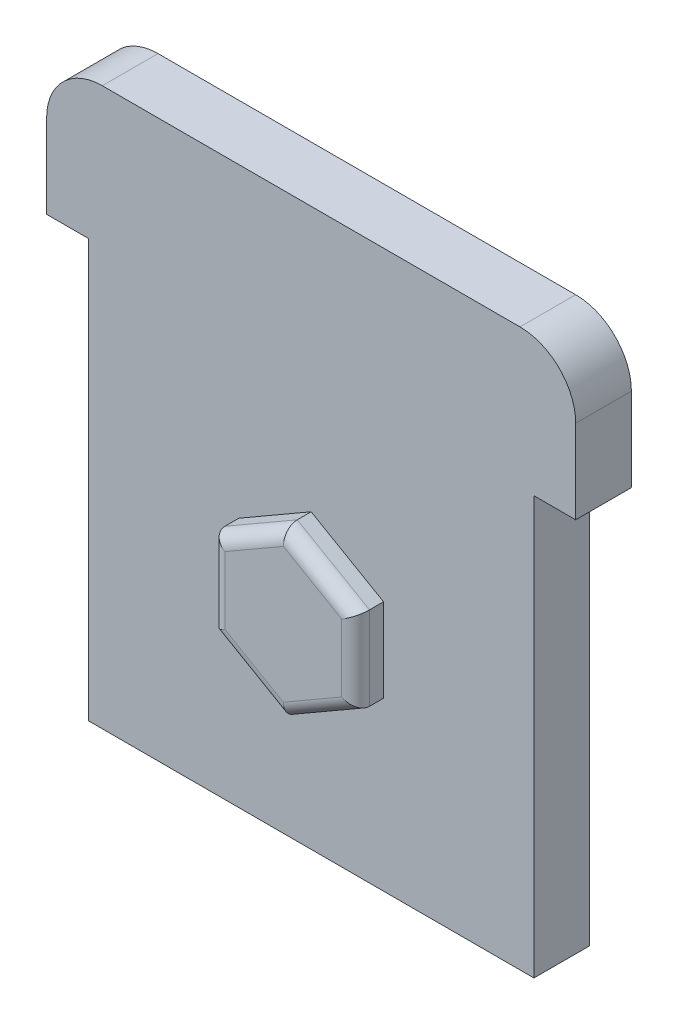
ISO-10303-21;
HEADER;
FILE_DESCRIPTION(('STEP AP214'),'2;1');
FILE_NAME('part.step','',(''),(''),'','','');
FILE_SCHEMA(('AUTOMOTIVE_DESIGN { 1 0 10303 214 1 1 1 1 }'));
ENDSEC;
DATA;
#1=APPLICATION_CONTEXT('core data for automotive mechanical design processes');
#2=APPLICATION_PROTOCOL_DEFINITION('international standard','automotive_design',2000,#1);
#3=PRODUCT_CONTEXT('',#1,'mechanical');
#4=PRODUCT('Part','Part','',(#3));
#5=PRODUCT_RELATED_PRODUCT_CATEGORY('part','',(#4));
#6=PRODUCT_DEFINITION_FORMATION('','',#4);
#7=PRODUCT_DEFINITION_CONTEXT('part definition',#1,'design');
#8=PRODUCT_DEFINITION('design','',#6,#7);
#9=PRODUCT_DEFINITION_SHAPE('','',#8);
#10=(LENGTH_UNIT() NAMED_UNIT(*) SI_UNIT(.MILLI.,.METRE.));
#11=(NAMED_UNIT(*) PLANE_ANGLE_UNIT() SI_UNIT($,.RADIAN.));
#12=(NAMED_UNIT(*) SI_UNIT($,.STERADIAN.) SOLID_ANGLE_UNIT());
#13=UNCERTAINTY_MEASURE_WITH_UNIT(LENGTH_MEASURE(1.E-05),#10,'distance_accuracy_value','');
#14=(GEOMETRIC_REPRESENTATION_CONTEXT(3) GLOBAL_UNCERTAINTY_ASSIGNED_CONTEXT((#13)) GLOBAL_UNIT_ASSIGNED_CONTEXT((#10,
#11,#12)) REPRESENTATION_CONTEXT('',''));
#15=CARTESIAN_POINT('',(0.,0.,0.));
#16=DIRECTION('',(0.,0.,1.));
#17=DIRECTION('',(1.,0.,0.));
#18=AXIS2_PLACEMENT_3D('',#15,#16,#17);
#19=CARTESIAN_POINT('',(0.,0.,2.));
#20=DIRECTION('',(0.,1.,0.));
#21=DIRECTION('',(-1.,0.,0.));
#22=AXIS2_PLACEMENT_3D('',#19,#20,#21);
#23=PLANE('',#22);
#24=DIRECTION('',(1.,0.,0.));
#25=VECTOR('',#24,1.);
#26=CARTESIAN_POINT('',(0.,0.,0.));
#27=LINE('',#26,#25);
#28=CARTESIAN_POINT('',(-1.5,0.,0.));
#29=VERTEX_POINT('',#28);
#30=CARTESIAN_POINT('',(0.,0.,0.));
#31=VERTEX_POINT('',#30);
#32=EDGE_CURVE('E204',#29,#31,#27,.T.);
#33=ORIENTED_EDGE('',*,*,#32,.T.);
#34=DIRECTION('',(0.,0.,-1.));
#35=VECTOR('',#34,1.);
#36=CARTESIAN_POINT('',(0.,0.,2.));
#37=LINE('',#36,#35);
#38=CARTESIAN_POINT('',(0.,0.,2.));
#39=VERTEX_POINT('',#38);
#40=EDGE_CURVE('E257',#39,#31,#37,.T.);
#41=ORIENTED_EDGE('',*,*,#40,.F.);
#42=DIRECTION('',(1.,0.,0.));
#43=VECTOR('',#42,1.);
#44=CARTESIAN_POINT('',(0.,0.,2.));
#45=LINE('',#44,#43);
#46=CARTESIAN_POINT('',(-1.5,0.,2.));
#47=VERTEX_POINT('',#46);
#48=EDGE_CURVE('E205',#47,#39,#45,.T.);
#49=ORIENTED_EDGE('',*,*,#48,.F.);
#50=DIRECTION('',(0.,0.,-1.));
#51=VECTOR('',#50,1.);
#52=CARTESIAN_POINT('',(-1.5,0.,2.));
#53=LINE('',#52,#51);
#54=EDGE_CURVE('E226',#47,#29,#53,.T.);
#55=ORIENTED_EDGE('',*,*,#54,.T.);
#56=EDGE_LOOP('',(#33,#41,#49,#55));
#57=FACE_BOUND('',#56,.T.);
#58=ADVANCED_FACE('F33',(#57),#23,.F.);
#59=CARTESIAN_POINT('',(0.,0.,2.));
#60=DIRECTION('',(1.,0.,0.));
#61=DIRECTION('',(0.,1.,0.));
#62=AXIS2_PLACEMENT_3D('',#59,#60,#61);
#63=PLANE('',#62);
#64=DIRECTION('',(0.,-1.,0.));
#65=VECTOR('',#64,1.);
#66=CARTESIAN_POINT('',(0.,0.,0.));
#67=LINE('',#66,#65);
#68=CARTESIAN_POINT('',(0.,-15.,0.));
#69=VERTEX_POINT('',#68);
#70=EDGE_CURVE('E229',#31,#69,#67,.T.);
#71=ORIENTED_EDGE('',*,*,#70,.T.);
#72=DIRECTION('',(0.,0.,-1.));
#73=VECTOR('',#72,1.);
#74=CARTESIAN_POINT('',(0.,-15.,2.));
#75=LINE('',#74,#73);
#76=CARTESIAN_POINT('',(0.,-15.,2.));
#77=VERTEX_POINT('',#76);
#78=EDGE_CURVE('E254',#77,#69,#75,.T.);
#79=ORIENTED_EDGE('',*,*,#78,.F.);
#80=DIRECTION('',(0.,-1.,0.));
#81=VECTOR('',#80,1.);
#82=CARTESIAN_POINT('',(0.,0.,2.));
#83=LINE('',#82,#81);
#84=EDGE_CURVE('E208',#39,#77,#83,.T.);
#85=ORIENTED_EDGE('',*,*,#84,.F.);
#86=ORIENTED_EDGE('',*,*,#40,.T.);
#87=EDGE_LOOP('',(#71,#79,#85,#86));
#88=FACE_BOUND('',#87,.T.);
#89=ADVANCED_FACE('F359',(#88),#63,.F.);
#90=CARTESIAN_POINT('',(0.,-15.,2.));
#91=DIRECTION('',(0.,1.,0.));
#92=DIRECTION('',(0.,0.,1.));
#93=AXIS2_PLACEMENT_3D('',#90,#91,#92);
#94=PLANE('',#93);
#95=DIRECTION('',(1.,0.,0.));
#96=VECTOR('',#95,1.);
#97=CARTESIAN_POINT('',(0.,-15.,0.));
#98=LINE('',#97,#96);
#99=CARTESIAN_POINT('',(16.,-15.,0.));
#100=VERTEX_POINT('',#99);
#101=EDGE_CURVE('E232',#69,#100,#98,.T.);
#102=ORIENTED_EDGE('',*,*,#101,.T.);
#103=DIRECTION('',(0.,0.,-1.));
#104=VECTOR('',#103,1.);
#105=CARTESIAN_POINT('',(16.,-15.,2.));
#106=LINE('',#105,#104);
#107=CARTESIAN_POINT('',(16.,-15.,2.));
#108=VERTEX_POINT('',#107);
#109=EDGE_CURVE('E252',#108,#100,#106,.T.);
#110=ORIENTED_EDGE('',*,*,#109,.F.);
#111=DIRECTION('',(1.,0.,0.));
#112=VECTOR('',#111,1.);
#113=CARTESIAN_POINT('',(0.,-15.,2.));
#114=LINE('',#113,#112);
#115=EDGE_CURVE('E212',#77,#108,#114,.T.);
#116=ORIENTED_EDGE('',*,*,#115,.F.);
#117=ORIENTED_EDGE('',*,*,#78,.T.);
#118=EDGE_LOOP('',(#102,#110,#116,#117));
#119=FACE_BOUND('',#118,.T.);
#120=ADVANCED_FACE('F366',(#119),#94,.F.);
#121=CARTESIAN_POINT('',(16.,0.,2.));
#122=DIRECTION('',(1.,0.,0.));
#123=DIRECTION('',(0.,1.,0.));
#124=AXIS2_PLACEMENT_3D('',#121,#122,#123);
#125=PLANE('',#124);
#126=DIRECTION('',(0.,-1.,0.));
#127=VECTOR('',#126,1.);
#128=CARTESIAN_POINT('',(16.,0.,0.));
#129=LINE('',#128,#127);
#130=CARTESIAN_POINT('',(16.,0.,0.));
#131=VERTEX_POINT('',#130);
#132=EDGE_CURVE('E235',#131,#100,#129,.T.);
#133=ORIENTED_EDGE('',*,*,#132,.F.);
#134=DIRECTION('',(0.,0.,-1.));
#135=VECTOR('',#134,1.);
#136=CARTESIAN_POINT('',(16.,0.,2.));
#137=LINE('',#136,#135);
#138=CARTESIAN_POINT('',(16.,0.,2.));
#139=VERTEX_POINT('',#138);
#140=EDGE_CURVE('E250',#139,#131,#137,.T.);
#141=ORIENTED_EDGE('',*,*,#140,.F.);
#142=DIRECTION('',(0.,-1.,0.));
#143=VECTOR('',#142,1.);
#144=CARTESIAN_POINT('',(16.,0.,2.));
#145=LINE('',#144,#143);
#146=EDGE_CURVE('E214',#139,#108,#145,.T.);
#147=ORIENTED_EDGE('',*,*,#146,.T.);
#148=ORIENTED_EDGE('',*,*,#109,.T.);
#149=EDGE_LOOP('',(#133,#141,#147,#148));
#150=FACE_BOUND('',#149,.T.);
#151=ADVANCED_FACE('F373',(#150),#125,.T.);
#152=CARTESIAN_POINT('',(17.5,0.,0.));
#153=VERTEX_POINT('',#152);
#154=EDGE_CURVE('E230',#131,#153,#27,.T.);
#155=ORIENTED_EDGE('',*,*,#154,.T.);
#156=DIRECTION('',(0.,0.,-1.));
#157=VECTOR('',#156,1.);
#158=CARTESIAN_POINT('',(17.5,0.,2.));
#159=LINE('',#158,#157);
#160=CARTESIAN_POINT('',(17.5,0.,2.));
#161=VERTEX_POINT('',#160);
#162=EDGE_CURVE('E247',#161,#153,#159,.T.);
#163=ORIENTED_EDGE('',*,*,#162,.F.);
#164=EDGE_CURVE('E210',#139,#161,#45,.T.);
#165=ORIENTED_EDGE('',*,*,#164,.F.);
#166=ORIENTED_EDGE('',*,*,#140,.T.);
#167=EDGE_LOOP('',(#155,#163,#165,#166));
#168=FACE_BOUND('',#167,.T.);
#169=ADVANCED_FACE('F362',(#168),#23,.F.);
#170=CARTESIAN_POINT('',(17.5,0.,2.));
#171=DIRECTION('',(-1.,0.,0.));
#172=DIRECTION('',(0.,0.,1.));
#173=AXIS2_PLACEMENT_3D('',#170,#171,#172);
#174=PLANE('',#173);
#175=DIRECTION('',(0.,1.,0.));
#176=VECTOR('',#175,1.);
#177=CARTESIAN_POINT('',(17.5,0.,0.));
#178=LINE('',#177,#176);
#179=CARTESIAN_POINT('',(17.5,3.,0.));
#180=VERTEX_POINT('',#179);
#181=EDGE_CURVE('E238',#153,#180,#178,.T.);
#182=ORIENTED_EDGE('',*,*,#181,.T.);
#183=DIRECTION('',(0.,0.,-1.));
#184=VECTOR('',#183,1.);
#185=CARTESIAN_POINT('',(17.5,3.,2.));
#186=LINE('',#185,#184);
#187=CARTESIAN_POINT('',(17.5,3.,2.));
#188=VERTEX_POINT('',#187);
#189=EDGE_CURVE('E276',#180,#188,#186,.F.);
#190=ORIENTED_EDGE('',*,*,#189,.T.);
#191=DIRECTION('',(0.,1.,0.));
#192=VECTOR('',#191,1.);
#193=CARTESIAN_POINT('',(17.5,0.,2.));
#194=LINE('',#193,#192);
#195=EDGE_CURVE('E217',#161,#188,#194,.T.);
#196=ORIENTED_EDGE('',*,*,#195,.F.);
#197=ORIENTED_EDGE('',*,*,#162,.T.);
#198=EDGE_LOOP('',(#182,#190,#196,#197));
#199=FACE_BOUND('',#198,.T.);
#200=ADVANCED_FACE('F372',(#199),#174,.F.);
#201=CARTESIAN_POINT('',(0.,5.,2.));
#202=DIRECTION('',(0.,1.,0.));
#203=DIRECTION('',(0.,0.,1.));
#204=AXIS2_PLACEMENT_3D('',#201,#202,#203);
#205=PLANE('',#204);
#206=DIRECTION('',(1.,0.,0.));
#207=VECTOR('',#206,1.);
#208=CARTESIAN_POINT('',(0.,5.,0.));
#209=LINE('',#208,#207);
#210=CARTESIAN_POINT('',(0.5,5.,0.));
#211=VERTEX_POINT('',#210);
#212=CARTESIAN_POINT('',(15.5,5.,0.));
#213=VERTEX_POINT('',#212);
#214=EDGE_CURVE('E241',#211,#213,#209,.T.);
#215=ORIENTED_EDGE('',*,*,#214,.F.);
#216=DIRECTION('',(0.,0.,-1.));
#217=VECTOR('',#216,1.);
#218=CARTESIAN_POINT('',(0.5,5.,2.));
#219=LINE('',#218,#217);
#220=CARTESIAN_POINT('',(0.5,5.,2.));
#221=VERTEX_POINT('',#220);
#222=EDGE_CURVE('E270',#211,#221,#219,.F.);
#223=ORIENTED_EDGE('',*,*,#222,.T.);
#224=DIRECTION('',(1.,0.,0.));
#225=VECTOR('',#224,1.);
#226=CARTESIAN_POINT('',(0.,5.,2.));
#227=LINE('',#226,#225);
#228=CARTESIAN_POINT('',(15.5,5.,2.));
#229=VERTEX_POINT('',#228);
#230=EDGE_CURVE('E220',#221,#229,#227,.T.);
#231=ORIENTED_EDGE('',*,*,#230,.T.);
#232=DIRECTION('',(0.,0.,-1.));
#233=VECTOR('',#232,1.);
#234=CARTESIAN_POINT('',(15.5,5.,0.));
#235=LINE('',#234,#233);
#236=EDGE_CURVE('E267',#229,#213,#235,.T.);
#237=ORIENTED_EDGE('',*,*,#236,.T.);
#238=EDGE_LOOP('',(#215,#223,#231,#237));
#239=FACE_BOUND('',#238,.T.);
#240=ADVANCED_FACE('F379',(#239),#205,.T.);
#241=CARTESIAN_POINT('',(-1.5,0.,2.));
#242=DIRECTION('',(-1.,0.,0.));
#243=DIRECTION('',(0.,0.,1.));
#244=AXIS2_PLACEMENT_3D('',#241,#242,#243);
#245=PLANE('',#244);
#246=DIRECTION('',(0.,1.,0.));
#247=VECTOR('',#246,1.);
#248=CARTESIAN_POINT('',(-1.5,0.,2.));
#249=LINE('',#248,#247);
#250=CARTESIAN_POINT('',(-1.5,3.,2.));
#251=VERTEX_POINT('',#250);
#252=EDGE_CURVE('E223',#47,#251,#249,.T.);
#253=ORIENTED_EDGE('',*,*,#252,.T.);
#254=DIRECTION('',(0.,0.,-1.));
#255=VECTOR('',#254,1.);
#256=CARTESIAN_POINT('',(-1.5,3.,2.));
#257=LINE('',#256,#255);
#258=CARTESIAN_POINT('',(-1.5,3.,0.));
#259=VERTEX_POINT('',#258);
#260=EDGE_CURVE('E260',#251,#259,#257,.T.);
#261=ORIENTED_EDGE('',*,*,#260,.T.);
#262=DIRECTION('',(0.,1.,0.));
#263=VECTOR('',#262,1.);
#264=CARTESIAN_POINT('',(-1.5,0.,0.));
#265=LINE('',#264,#263);
#266=EDGE_CURVE('E209',#29,#259,#265,.T.);
#267=ORIENTED_EDGE('',*,*,#266,.F.);
#268=ORIENTED_EDGE('',*,*,#54,.F.);
#269=EDGE_LOOP('',(#253,#261,#267,#268));
#270=FACE_BOUND('',#269,.T.);
#271=ADVANCED_FACE('F406',(#270),#245,.T.);
#272=CARTESIAN_POINT('',(0.,0.,2.));
#273=DIRECTION('',(0.,0.,1.));
#274=DIRECTION('',(1.,0.,0.));
#275=AXIS2_PLACEMENT_3D('',#272,#273,#274);
#276=PLANE('',#275);
#277=DIRECTION('',(-0.866025403784439,0.5,0.));
#278=VECTOR('',#277,1.);
#279=CARTESIAN_POINT('',(10.5980762113533,-6.,2.));
#280=LINE('',#279,#278);
#281=CARTESIAN_POINT('',(10.5980762113533,-6.,2.));
#282=VERTEX_POINT('',#281);
#283=CARTESIAN_POINT('',(8.,-4.5,2.));
#284=VERTEX_POINT('',#283);
#285=EDGE_CURVE('E185',#282,#284,#280,.T.);
#286=ORIENTED_EDGE('',*,*,#285,.F.);
#287=DIRECTION('',(0.,1.,0.));
#288=VECTOR('',#287,1.);
#289=CARTESIAN_POINT('',(10.5980762113533,-9.,2.));
#290=LINE('',#289,#288);
#291=CARTESIAN_POINT('',(10.5980762113533,-9.,2.));
#292=VERTEX_POINT('',#291);
#293=EDGE_CURVE('E193',#292,#282,#290,.T.);
#294=ORIENTED_EDGE('',*,*,#293,.F.);
#295=DIRECTION('',(0.866025403784438,0.5,0.));
#296=VECTOR('',#295,1.);
#297=CARTESIAN_POINT('',(8.,-10.5,2.));
#298=LINE('',#297,#296);
#299=CARTESIAN_POINT('',(8.,-10.5,2.));
#300=VERTEX_POINT('',#299);
#301=EDGE_CURVE('E190',#300,#292,#298,.T.);
#302=ORIENTED_EDGE('',*,*,#301,.F.);
#303=DIRECTION('',(0.866025403784439,-0.5,0.));
#304=VECTOR('',#303,1.);
#305=CARTESIAN_POINT('',(5.40192378864669,-9.,2.));
#306=LINE('',#305,#304);
#307=CARTESIAN_POINT('',(5.40192378864669,-9.,2.));
#308=VERTEX_POINT('',#307);
#309=EDGE_CURVE('E182',#308,#300,#306,.T.);
#310=ORIENTED_EDGE('',*,*,#309,.F.);
#311=DIRECTION('',(0.,-1.,0.));
#312=VECTOR('',#311,1.);
#313=CARTESIAN_POINT('',(5.40192378864669,-6.,2.));
#314=LINE('',#313,#312);
#315=CARTESIAN_POINT('',(5.40192378864669,-6.,2.));
#316=VERTEX_POINT('',#315);
#317=EDGE_CURVE('E166',#316,#308,#314,.T.);
#318=ORIENTED_EDGE('',*,*,#317,.F.);
#319=DIRECTION('',(-0.866025403784439,-0.5,0.));
#320=VECTOR('',#319,1.);
#321=CARTESIAN_POINT('',(8.,-4.5,2.));
#322=LINE('',#321,#320);
#323=EDGE_CURVE('E178',#284,#316,#322,.T.);
#324=ORIENTED_EDGE('',*,*,#323,.F.);
#325=EDGE_LOOP('',(#286,#294,#302,#310,#318,#324));
#326=FACE_BOUND('',#325,.T.);
#327=ORIENTED_EDGE('',*,*,#230,.F.);
#328=CARTESIAN_POINT('',(0.5,3.,2.));
#329=DIRECTION('',(0.,0.,1.));
#330=DIRECTION('',(1.,0.,0.));
#331=AXIS2_PLACEMENT_3D('',#328,#329,#330);
#332=CIRCLE('',#331,2.);
#333=EDGE_CURVE('E274',#221,#251,#332,.T.);
#334=ORIENTED_EDGE('',*,*,#333,.T.);
#335=ORIENTED_EDGE('',*,*,#252,.F.);
#336=ORIENTED_EDGE('',*,*,#48,.T.);
#337=ORIENTED_EDGE('',*,*,#84,.T.);
#338=ORIENTED_EDGE('',*,*,#115,.T.);
#339=ORIENTED_EDGE('',*,*,#146,.F.);
#340=ORIENTED_EDGE('',*,*,#164,.T.);
#341=ORIENTED_EDGE('',*,*,#195,.T.);
#342=CARTESIAN_POINT('',(15.5,3.,2.));
#343=DIRECTION('',(0.,0.,1.));
#344=DIRECTION('',(1.,0.,0.));
#345=AXIS2_PLACEMENT_3D('',#342,#343,#344);
#346=CIRCLE('',#345,2.);
#347=EDGE_CURVE('E272',#188,#229,#346,.T.);
#348=ORIENTED_EDGE('',*,*,#347,.T.);
#349=EDGE_LOOP('',(#327,#334,#335,#336,#337,#338,#339,#340,#341,#348));
#350=FACE_BOUND('',#349,.T.);
#351=ADVANCED_FACE('F176',(#326,#350),#276,.T.);
#352=CARTESIAN_POINT('',(0.,0.,0.));
#353=DIRECTION('',(0.,0.,1.));
#354=DIRECTION('',(1.,0.,0.));
#355=AXIS2_PLACEMENT_3D('',#352,#353,#354);
#356=PLANE('',#355);
#357=ORIENTED_EDGE('',*,*,#266,.T.);
#358=CARTESIAN_POINT('',(0.5,3.,0.));
#359=DIRECTION('',(0.,0.,1.));
#360=DIRECTION('',(1.,0.,0.));
#361=AXIS2_PLACEMENT_3D('',#358,#359,#360);
#362=CIRCLE('',#361,2.);
#363=EDGE_CURVE('E265',#259,#211,#362,.F.);
#364=ORIENTED_EDGE('',*,*,#363,.T.);
#365=ORIENTED_EDGE('',*,*,#214,.T.);
#366=CARTESIAN_POINT('',(15.5,3.,0.));
#367=DIRECTION('',(0.,0.,1.));
#368=DIRECTION('',(1.,0.,0.));
#369=AXIS2_PLACEMENT_3D('',#366,#367,#368);
#370=CIRCLE('',#369,2.);
#371=EDGE_CURVE('E263',#213,#180,#370,.F.);
#372=ORIENTED_EDGE('',*,*,#371,.T.);
#373=ORIENTED_EDGE('',*,*,#181,.F.);
#374=ORIENTED_EDGE('',*,*,#154,.F.);
#375=ORIENTED_EDGE('',*,*,#132,.T.);
#376=ORIENTED_EDGE('',*,*,#101,.F.);
#377=ORIENTED_EDGE('',*,*,#70,.F.);
#378=ORIENTED_EDGE('',*,*,#32,.F.);
#379=EDGE_LOOP('',(#357,#364,#365,#372,#373,#374,#375,#376,#377,#378));
#380=FACE_BOUND('',#379,.T.);
#381=ADVANCED_FACE('F390',(#380),#356,.F.);
#382=CARTESIAN_POINT('',(0.5,3.,2.));
#383=DIRECTION('',(0.,0.,-1.));
#384=DIRECTION('',(-1.,0.,0.));
#385=AXIS2_PLACEMENT_3D('',#382,#383,#384);
#386=CYLINDRICAL_SURFACE('',#385,2.);
#387=ORIENTED_EDGE('',*,*,#333,.F.);
#388=ORIENTED_EDGE('',*,*,#222,.F.);
#389=ORIENTED_EDGE('',*,*,#363,.F.);
#390=ORIENTED_EDGE('',*,*,#260,.F.);
#391=EDGE_LOOP('',(#387,#388,#389,#390));
#392=FACE_BOUND('',#391,.T.);
#393=ADVANCED_FACE('F403',(#392),#386,.T.);
#394=CARTESIAN_POINT('',(15.5,3.,2.));
#395=DIRECTION('',(0.,0.,1.));
#396=DIRECTION('',(1.,0.,0.));
#397=AXIS2_PLACEMENT_3D('',#394,#395,#396);
#398=CYLINDRICAL_SURFACE('',#397,2.);
#399=ORIENTED_EDGE('',*,*,#347,.F.);
#400=ORIENTED_EDGE('',*,*,#189,.F.);
#401=ORIENTED_EDGE('',*,*,#371,.F.);
#402=ORIENTED_EDGE('',*,*,#236,.F.);
#403=EDGE_LOOP('',(#399,#400,#401,#402));
#404=FACE_BOUND('',#403,.T.);
#405=ADVANCED_FACE('F395',(#404),#398,.T.);
#406=CARTESIAN_POINT('',(10.5980762113533,-6.,3.));
#407=DIRECTION('',(-0.5,-0.866025403784439,0.));
#408=DIRECTION('',(0.866025403784439,-0.5,0.));
#409=AXIS2_PLACEMENT_3D('',#406,#407,#408);
#410=PLANE('',#409);
#411=DIRECTION('',(0.,0.,-1.));
#412=VECTOR('',#411,1.);
#413=CARTESIAN_POINT('',(8.,-4.5,3.));
#414=LINE('',#413,#412);
#415=CARTESIAN_POINT('',(8.,-4.5,2.5));
#416=VERTEX_POINT('',#415);
#417=EDGE_CURVE('E169',#416,#284,#414,.T.);
#418=ORIENTED_EDGE('',*,*,#417,.F.);
#419=DIRECTION('',(-0.866025403784439,0.5,0.));
#420=VECTOR('',#419,1.);
#421=CARTESIAN_POINT('',(10.5980762113533,-6.,2.5));
#422=LINE('',#421,#420);
#423=CARTESIAN_POINT('',(10.5980762113533,-6.,2.5));
#424=VERTEX_POINT('',#423);
#425=EDGE_CURVE('E11',#416,#424,#422,.F.);
#426=ORIENTED_EDGE('',*,*,#425,.T.);
#427=DIRECTION('',(0.,0.,-1.));
#428=VECTOR('',#427,1.);
#429=CARTESIAN_POINT('',(10.5980762113533,-6.,3.));
#430=LINE('',#429,#428);
#431=EDGE_CURVE('E196',#424,#282,#430,.T.);
#432=ORIENTED_EDGE('',*,*,#431,.T.);
#433=ORIENTED_EDGE('',*,*,#285,.T.);
#434=EDGE_LOOP('',(#418,#426,#432,#433));
#435=FACE_BOUND('',#434,.T.);
#436=ADVANCED_FACE('F331',(#435),#410,.F.);
#437=CARTESIAN_POINT('',(8.,-4.5,3.));
#438=DIRECTION('',(0.5,-0.866025403784439,0.));
#439=DIRECTION('',(0.866025403784439,0.5,0.));
#440=AXIS2_PLACEMENT_3D('',#437,#438,#439);
#441=PLANE('',#440);
#442=DIRECTION('',(0.,0.,-1.));
#443=VECTOR('',#442,1.);
#444=CARTESIAN_POINT('',(5.40192378864669,-6.,3.));
#445=LINE('',#444,#443);
#446=CARTESIAN_POINT('',(5.40192378864669,-6.,2.5));
#447=VERTEX_POINT('',#446);
#448=EDGE_CURVE('E163',#447,#316,#445,.T.);
#449=ORIENTED_EDGE('',*,*,#448,.F.);
#450=DIRECTION('',(-0.866025403784439,-0.5,0.));
#451=VECTOR('',#450,1.);
#452=CARTESIAN_POINT('',(8.,-4.5,2.5));
#453=LINE('',#452,#451);
#454=EDGE_CURVE('E42',#447,#416,#453,.F.);
#455=ORIENTED_EDGE('',*,*,#454,.T.);
#456=ORIENTED_EDGE('',*,*,#417,.T.);
#457=ORIENTED_EDGE('',*,*,#323,.T.);
#458=EDGE_LOOP('',(#449,#455,#456,#457));
#459=FACE_BOUND('',#458,.T.);
#460=ADVANCED_FACE('F184',(#459),#441,.F.);
#461=CARTESIAN_POINT('',(5.40192378864669,-6.,3.));
#462=DIRECTION('',(1.,0.,0.));
#463=DIRECTION('',(0.,1.,0.));
#464=AXIS2_PLACEMENT_3D('',#461,#462,#463);
#465=PLANE('',#464);
#466=DIRECTION('',(0.,0.,-1.));
#467=VECTOR('',#466,1.);
#468=CARTESIAN_POINT('',(5.40192378864669,-9.,3.));
#469=LINE('',#468,#467);
#470=CARTESIAN_POINT('',(5.40192378864669,-9.,2.5));
#471=VERTEX_POINT('',#470);
#472=EDGE_CURVE('E170',#471,#308,#469,.T.);
#473=ORIENTED_EDGE('',*,*,#472,.F.);
#474=DIRECTION('',(0.,-1.,0.));
#475=VECTOR('',#474,1.);
#476=CARTESIAN_POINT('',(5.40192378864669,-6.,2.5));
#477=LINE('',#476,#475);
#478=EDGE_CURVE('E57',#471,#447,#477,.F.);
#479=ORIENTED_EDGE('',*,*,#478,.T.);
#480=ORIENTED_EDGE('',*,*,#448,.T.);
#481=ORIENTED_EDGE('',*,*,#317,.T.);
#482=EDGE_LOOP('',(#473,#479,#480,#481));
#483=FACE_BOUND('',#482,.T.);
#484=ADVANCED_FACE('F165',(#483),#465,.F.);
#485=CARTESIAN_POINT('',(5.40192378864669,-9.,3.));
#486=DIRECTION('',(0.5,0.866025403784439,0.));
#487=DIRECTION('',(-0.866025403784439,0.5,0.));
#488=AXIS2_PLACEMENT_3D('',#485,#486,#487);
#489=PLANE('',#488);
#490=DIRECTION('',(0.,0.,-1.));
#491=VECTOR('',#490,1.);
#492=CARTESIAN_POINT('',(8.,-10.5,3.));
#493=LINE('',#492,#491);
#494=CARTESIAN_POINT('',(8.,-10.5,2.5));
#495=VERTEX_POINT('',#494);
#496=EDGE_CURVE('E200',#495,#300,#493,.T.);
#497=ORIENTED_EDGE('',*,*,#496,.F.);
#498=DIRECTION('',(0.866025403784439,-0.5,0.));
#499=VECTOR('',#498,1.);
#500=CARTESIAN_POINT('',(5.40192378864669,-9.,2.5));
#501=LINE('',#500,#499);
#502=EDGE_CURVE('E296',#495,#471,#501,.F.);
#503=ORIENTED_EDGE('',*,*,#502,.T.);
#504=ORIENTED_EDGE('',*,*,#472,.T.);
#505=ORIENTED_EDGE('',*,*,#309,.T.);
#506=EDGE_LOOP('',(#497,#503,#504,#505));
#507=FACE_BOUND('',#506,.T.);
#508=ADVANCED_FACE('F349',(#507),#489,.F.);
#509=CARTESIAN_POINT('',(8.,-10.5,3.));
#510=DIRECTION('',(-0.5,0.866025403784438,0.));
#511=DIRECTION('',(-0.866025403784438,-0.5,0.));
#512=AXIS2_PLACEMENT_3D('',#509,#510,#511);
#513=PLANE('',#512);
#514=DIRECTION('',(0.,0.,-1.));
#515=VECTOR('',#514,1.);
#516=CARTESIAN_POINT('',(10.5980762113533,-9.,3.));
#517=LINE('',#516,#515);
#518=CARTESIAN_POINT('',(10.5980762113533,-9.,2.5));
#519=VERTEX_POINT('',#518);
#520=EDGE_CURVE('E198',#519,#292,#517,.T.);
#521=ORIENTED_EDGE('',*,*,#520,.F.);
#522=DIRECTION('',(0.866025403784438,0.5,0.));
#523=VECTOR('',#522,1.);
#524=CARTESIAN_POINT('',(8.,-10.5,2.5));
#525=LINE('',#524,#523);
#526=EDGE_CURVE('E294',#519,#495,#525,.F.);
#527=ORIENTED_EDGE('',*,*,#526,.T.);
#528=ORIENTED_EDGE('',*,*,#496,.T.);
#529=ORIENTED_EDGE('',*,*,#301,.T.);
#530=EDGE_LOOP('',(#521,#527,#528,#529));
#531=FACE_BOUND('',#530,.T.);
#532=ADVANCED_FACE('F347',(#531),#513,.F.);
#533=CARTESIAN_POINT('',(10.5980762113533,-9.,3.));
#534=DIRECTION('',(-1.,0.,0.));
#535=DIRECTION('',(0.,0.,1.));
#536=AXIS2_PLACEMENT_3D('',#533,#534,#535);
#537=PLANE('',#536);
#538=ORIENTED_EDGE('',*,*,#431,.F.);
#539=DIRECTION('',(0.,1.,0.));
#540=VECTOR('',#539,1.);
#541=CARTESIAN_POINT('',(10.5980762113533,-9.,2.5));
#542=LINE('',#541,#540);
#543=EDGE_CURVE('E291',#424,#519,#542,.F.);
#544=ORIENTED_EDGE('',*,*,#543,.T.);
#545=ORIENTED_EDGE('',*,*,#520,.T.);
#546=ORIENTED_EDGE('',*,*,#293,.T.);
#547=EDGE_LOOP('',(#538,#544,#545,#546));
#548=FACE_BOUND('',#547,.T.);
#549=ADVANCED_FACE('F334',(#548),#537,.F.);
#550=CARTESIAN_POINT('',(0.,0.,3.));
#551=DIRECTION('',(0.,0.,1.));
#552=DIRECTION('',(1.,0.,0.));
#553=AXIS2_PLACEMENT_3D('',#550,#551,#552);
#554=PLANE('',#553);
#555=DIRECTION('',(0.866025403784438,0.5,0.));
#556=VECTOR('',#555,1.);
#557=CARTESIAN_POINT('',(10.3480762113533,-8.56698729810778,3.));
#558=LINE('',#557,#556);
#559=CARTESIAN_POINT('',(8.,-9.92264973081037,3.));
#560=VERTEX_POINT('',#559);
#561=CARTESIAN_POINT('',(10.0980762113533,-8.71132486540519,3.));
#562=VERTEX_POINT('',#561);
#563=EDGE_CURVE('E286',#560,#562,#558,.T.);
#564=ORIENTED_EDGE('',*,*,#563,.T.);
#565=DIRECTION('',(0.,1.,0.));
#566=VECTOR('',#565,1.);
#567=CARTESIAN_POINT('',(10.0980762113533,-6.,3.));
#568=LINE('',#567,#566);
#569=CARTESIAN_POINT('',(10.0980762113533,-6.28867513459481,3.));
#570=VERTEX_POINT('',#569);
#571=EDGE_CURVE('E288',#562,#570,#568,.T.);
#572=ORIENTED_EDGE('',*,*,#571,.T.);
#573=DIRECTION('',(-0.866025403784439,0.5,0.));
#574=VECTOR('',#573,1.);
#575=CARTESIAN_POINT('',(7.75,-4.93301270189222,3.));
#576=LINE('',#575,#574);
#577=CARTESIAN_POINT('',(8.,-5.07735026918963,3.));
#578=VERTEX_POINT('',#577);
#579=EDGE_CURVE('E278',#570,#578,#576,.T.);
#580=ORIENTED_EDGE('',*,*,#579,.T.);
#581=DIRECTION('',(-0.866025403784439,-0.5,0.));
#582=VECTOR('',#581,1.);
#583=CARTESIAN_POINT('',(5.65192378864669,-6.43301270189222,3.));
#584=LINE('',#583,#582);
#585=CARTESIAN_POINT('',(5.90192378864669,-6.28867513459481,3.));
#586=VERTEX_POINT('',#585);
#587=EDGE_CURVE('E280',#578,#586,#584,.T.);
#588=ORIENTED_EDGE('',*,*,#587,.T.);
#589=DIRECTION('',(0.,-1.,0.));
#590=VECTOR('',#589,1.);
#591=CARTESIAN_POINT('',(5.90192378864669,-9.,3.));
#592=LINE('',#591,#590);
#593=CARTESIAN_POINT('',(5.90192378864669,-8.71132486540519,3.));
#594=VERTEX_POINT('',#593);
#595=EDGE_CURVE('E282',#586,#594,#592,.T.);
#596=ORIENTED_EDGE('',*,*,#595,.T.);
#597=DIRECTION('',(0.866025403784439,-0.5,0.));
#598=VECTOR('',#597,1.);
#599=CARTESIAN_POINT('',(8.25000000000001,-10.0669872981078,3.));
#600=LINE('',#599,#598);
#601=EDGE_CURVE('E284',#594,#560,#600,.T.);
#602=ORIENTED_EDGE('',*,*,#601,.T.);
#603=EDGE_LOOP('',(#564,#572,#580,#588,#596,#602));
#604=FACE_BOUND('',#603,.T.);
#605=ADVANCED_FACE('F436',(#604),#554,.T.);
#606=CARTESIAN_POINT('',(5.90192378864668,0.,2.5));
#607=DIRECTION('',(0.,1.,0.));
#608=DIRECTION('',(-1.,0.,0.));
#609=AXIS2_PLACEMENT_3D('',#606,#607,#608);
#610=CYLINDRICAL_SURFACE('',#609,0.5);
#611=CARTESIAN_POINT('',(5.90192378864669,-6.28867513459481,2.5));
#612=DIRECTION('',(0.5,0.866025403784439,0.));
#613=DIRECTION('',(0.866025403784439,-0.5,0.));
#614=AXIS2_PLACEMENT_3D('',#611,#612,#613);
#615=ELLIPSE('',#614,0.577350269189626,0.5);
#616=EDGE_CURVE('E309',#447,#586,#615,.T.);
#617=ORIENTED_EDGE('',*,*,#616,.F.);
#618=ORIENTED_EDGE('',*,*,#478,.F.);
#619=CARTESIAN_POINT('',(5.90192378864669,-8.71132486540519,2.5));
#620=DIRECTION('',(-0.5,0.866025403784438,0.));
#621=DIRECTION('',(0.866025403784439,0.5,0.));
#622=AXIS2_PLACEMENT_3D('',#619,#620,#621);
#623=ELLIPSE('',#622,0.577350269189626,0.5);
#624=EDGE_CURVE('E37',#594,#471,#623,.F.);
#625=ORIENTED_EDGE('',*,*,#624,.F.);
#626=ORIENTED_EDGE('',*,*,#595,.F.);
#627=EDGE_LOOP('',(#617,#618,#625,#626));
#628=FACE_BOUND('',#627,.T.);
#629=ADVANCED_FACE('F35',(#628),#610,.T.);
#630=CARTESIAN_POINT('',(-2.2966333698683,-3.97788568297003,2.5));
#631=DIRECTION('',(-0.866025403784439,0.5,0.));
#632=DIRECTION('',(-0.5,-0.866025403784439,0.));
#633=AXIS2_PLACEMENT_3D('',#630,#631,#632);
#634=CYLINDRICAL_SURFACE('',#633,0.5);
#635=ORIENTED_EDGE('',*,*,#624,.T.);
#636=ORIENTED_EDGE('',*,*,#502,.F.);
#637=CARTESIAN_POINT('',(8.,-9.92264973081037,2.5));
#638=DIRECTION('',(-1.,0.,0.));
#639=DIRECTION('',(0.,1.,0.));
#640=AXIS2_PLACEMENT_3D('',#637,#638,#639);
#641=ELLIPSE('',#640,0.577350269189626,0.5);
#642=EDGE_CURVE('E307',#560,#495,#641,.F.);
#643=ORIENTED_EDGE('',*,*,#642,.F.);
#644=ORIENTED_EDGE('',*,*,#601,.F.);
#645=EDGE_LOOP('',(#635,#636,#643,#644));
#646=FACE_BOUND('',#645,.T.);
#647=ADVANCED_FACE('F318',(#646),#634,.T.);
#648=CARTESIAN_POINT('',(4.19855715851499,-7.27211431702997,2.5));
#649=DIRECTION('',(0.866025403784439,0.5,0.));
#650=DIRECTION('',(-0.5,0.866025403784439,0.));
#651=AXIS2_PLACEMENT_3D('',#648,#649,#650);
#652=CYLINDRICAL_SURFACE('',#651,0.5);
#653=ORIENTED_EDGE('',*,*,#616,.T.);
#654=ORIENTED_EDGE('',*,*,#587,.F.);
#655=CARTESIAN_POINT('',(8.,-5.07735026918963,2.5));
#656=DIRECTION('',(1.,0.,0.));
#657=DIRECTION('',(0.,-1.,0.));
#658=AXIS2_PLACEMENT_3D('',#655,#656,#657);
#659=ELLIPSE('',#658,0.577350269189626,0.5);
#660=EDGE_CURVE('E304',#416,#578,#659,.T.);
#661=ORIENTED_EDGE('',*,*,#660,.F.);
#662=ORIENTED_EDGE('',*,*,#454,.F.);
#663=EDGE_LOOP('',(#653,#654,#661,#662));
#664=FACE_BOUND('',#663,.T.);
#665=ADVANCED_FACE('F323',(#664),#652,.T.);
#666=CARTESIAN_POINT('',(6.29663336986831,-10.9060889132455,2.5));
#667=DIRECTION('',(-0.866025403784438,-0.5,0.));
#668=DIRECTION('',(0.5,-0.866025403784438,0.));
#669=AXIS2_PLACEMENT_3D('',#666,#667,#668);
#670=CYLINDRICAL_SURFACE('',#669,0.5);
#671=ORIENTED_EDGE('',*,*,#642,.T.);
#672=ORIENTED_EDGE('',*,*,#526,.F.);
#673=CARTESIAN_POINT('',(10.0980762113533,-8.71132486540519,2.5));
#674=DIRECTION('',(-0.5,-0.866025403784439,0.));
#675=DIRECTION('',(-0.866025403784439,0.5,0.));
#676=AXIS2_PLACEMENT_3D('',#673,#674,#675);
#677=ELLIPSE('',#676,0.577350269189626,0.5);
#678=EDGE_CURVE('E302',#562,#519,#677,.F.);
#679=ORIENTED_EDGE('',*,*,#678,.F.);
#680=ORIENTED_EDGE('',*,*,#563,.F.);
#681=EDGE_LOOP('',(#671,#672,#679,#680));
#682=FACE_BOUND('',#681,.T.);
#683=ADVANCED_FACE('F344',(#682),#670,.T.);
#684=CARTESIAN_POINT('',(-0.198557158514989,-0.343911086754469,2.5));
#685=DIRECTION('',(0.866025403784439,-0.5,0.));
#686=DIRECTION('',(0.5,0.866025403784439,0.));
#687=AXIS2_PLACEMENT_3D('',#684,#685,#686);
#688=CYLINDRICAL_SURFACE('',#687,0.5);
#689=ORIENTED_EDGE('',*,*,#660,.T.);
#690=ORIENTED_EDGE('',*,*,#579,.F.);
#691=CARTESIAN_POINT('',(10.0980762113533,-6.28867513459481,2.5));
#692=DIRECTION('',(0.5,-0.866025403784438,0.));
#693=DIRECTION('',(0.866025403784438,0.5,0.));
#694=AXIS2_PLACEMENT_3D('',#691,#692,#693);
#695=ELLIPSE('',#694,0.577350269189626,0.5);
#696=EDGE_CURVE('E300',#424,#570,#695,.T.);
#697=ORIENTED_EDGE('',*,*,#696,.F.);
#698=ORIENTED_EDGE('',*,*,#425,.F.);
#699=EDGE_LOOP('',(#689,#690,#697,#698));
#700=FACE_BOUND('',#699,.T.);
#701=ADVANCED_FACE('F328',(#700),#688,.T.);
#702=CARTESIAN_POINT('',(10.0980762113533,0.,2.5));
#703=DIRECTION('',(0.,-1.,0.));
#704=DIRECTION('',(0.,0.,-1.));
#705=AXIS2_PLACEMENT_3D('',#702,#703,#704);
#706=CYLINDRICAL_SURFACE('',#705,0.5);
#707=ORIENTED_EDGE('',*,*,#678,.T.);
#708=ORIENTED_EDGE('',*,*,#543,.F.);
#709=ORIENTED_EDGE('',*,*,#696,.T.);
#710=ORIENTED_EDGE('',*,*,#571,.F.);
#711=EDGE_LOOP('',(#707,#708,#709,#710));
#712=FACE_BOUND('',#711,.T.);
#713=ADVANCED_FACE('F338',(#712),#706,.T.);
#714=CLOSED_SHELL('',(#58,#89,#120,#151,#169,#200,#240,#271,#351,#381,#393,#405,#436,#460,#484,
#508,#532,#549,#605,#629,#647,#665,#683,#701,#713));
#715=MANIFOLD_SOLID_BREP('B2',#714);
#716=ADVANCED_BREP_SHAPE_REPRESENTATION('',(#18,#715),#14);
#717=SHAPE_DEFINITION_REPRESENTATION(#9,#716);
ENDSEC;
END-ISO-10303-21;
